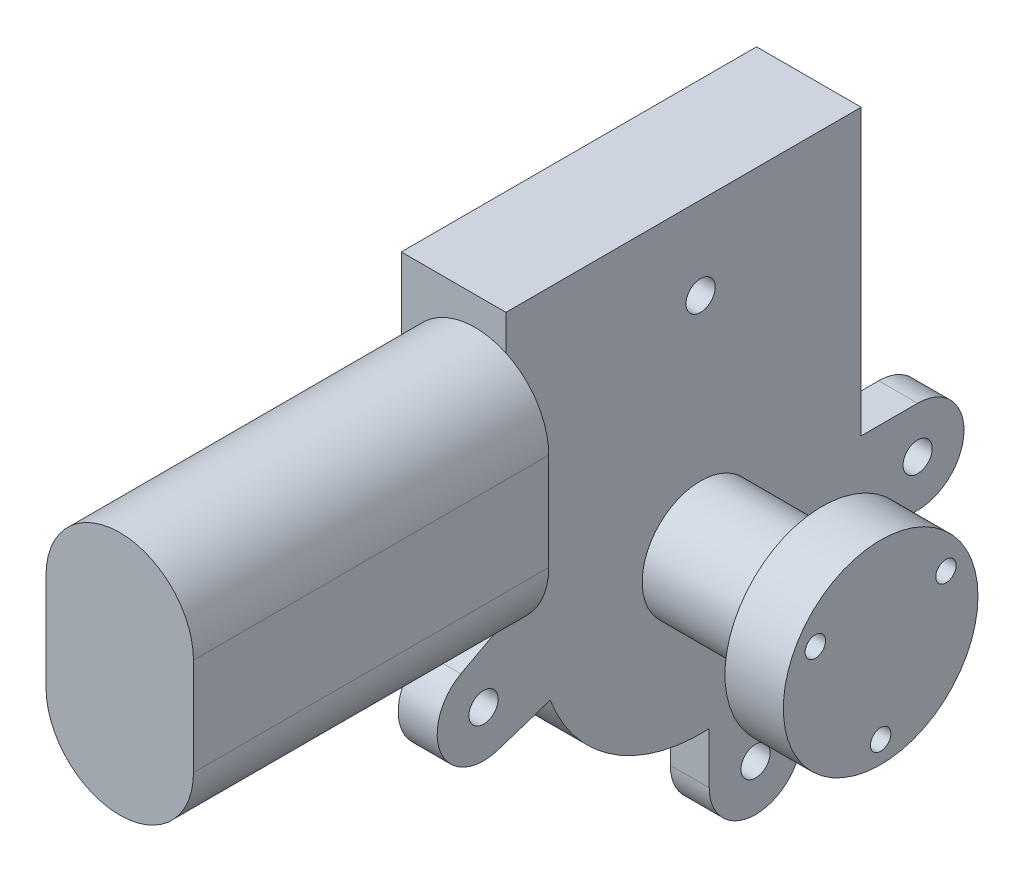
ISO-10303-21;
HEADER;
FILE_DESCRIPTION(('STEP AP214'),'2;1');
FILE_NAME('part.step','',(''),(''),'','','');
FILE_SCHEMA(('AUTOMOTIVE_DESIGN { 1 0 10303 214 1 1 1 1 }'));
ENDSEC;
DATA;
#1=APPLICATION_CONTEXT('core data for automotive mechanical design processes');
#2=APPLICATION_PROTOCOL_DEFINITION('international standard','automotive_design',2000,#1);
#3=PRODUCT_CONTEXT('',#1,'mechanical');
#4=PRODUCT('Part','Part','',(#3));
#5=PRODUCT_RELATED_PRODUCT_CATEGORY('part','',(#4));
#6=PRODUCT_DEFINITION_FORMATION('','',#4);
#7=PRODUCT_DEFINITION_CONTEXT('part definition',#1,'design');
#8=PRODUCT_DEFINITION('design','',#6,#7);
#9=PRODUCT_DEFINITION_SHAPE('','',#8);
#10=(LENGTH_UNIT() NAMED_UNIT(*) SI_UNIT(.MILLI.,.METRE.));
#11=(NAMED_UNIT(*) PLANE_ANGLE_UNIT() SI_UNIT($,.RADIAN.));
#12=(NAMED_UNIT(*) SI_UNIT($,.STERADIAN.) SOLID_ANGLE_UNIT());
#13=UNCERTAINTY_MEASURE_WITH_UNIT(LENGTH_MEASURE(1.E-05),#10,'distance_accuracy_value','');
#14=(GEOMETRIC_REPRESENTATION_CONTEXT(3) GLOBAL_UNCERTAINTY_ASSIGNED_CONTEXT((#13)) GLOBAL_UNIT_ASSIGNED_CONTEXT((#10,
#11,#12)) REPRESENTATION_CONTEXT('',''));
#15=CARTESIAN_POINT('',(0.,0.,0.));
#16=DIRECTION('',(0.,0.,1.));
#17=DIRECTION('',(1.,0.,0.));
#18=AXIS2_PLACEMENT_3D('',#15,#16,#17);
#19=CARTESIAN_POINT('',(0.,0.,73.));
#20=DIRECTION('',(0.,1.,0.));
#21=DIRECTION('',(0.,0.,1.));
#22=AXIS2_PLACEMENT_3D('',#19,#20,#21);
#23=PLANE('',#22);
#24=DIRECTION('',(0.,0.,-1.));
#25=VECTOR('',#24,1.);
#26=CARTESIAN_POINT('',(13.5,0.,73.));
#27=LINE('',#26,#25);
#28=CARTESIAN_POINT('',(13.5,0.,73.));
#29=VERTEX_POINT('',#28);
#30=CARTESIAN_POINT('',(13.5,0.,66.));
#31=VERTEX_POINT('',#30);
#32=EDGE_CURVE('E246',#29,#31,#27,.T.);
#33=ORIENTED_EDGE('',*,*,#32,.F.);
#34=DIRECTION('',(1.,0.,0.));
#35=VECTOR('',#34,1.);
#36=CARTESIAN_POINT('',(0.,0.,73.));
#37=LINE('',#36,#35);
#38=CARTESIAN_POINT('',(0.,0.,73.));
#39=VERTEX_POINT('',#38);
#40=EDGE_CURVE('E340',#39,#29,#37,.T.);
#41=ORIENTED_EDGE('',*,*,#40,.F.);
#42=DIRECTION('',(0.,0.,-1.));
#43=VECTOR('',#42,1.);
#44=CARTESIAN_POINT('',(0.,0.,73.));
#45=LINE('',#44,#43);
#46=CARTESIAN_POINT('',(0.,0.,66.));
#47=VERTEX_POINT('',#46);
#48=EDGE_CURVE('E364',#39,#47,#45,.T.);
#49=ORIENTED_EDGE('',*,*,#48,.T.);
#50=DIRECTION('',(-1.,0.,0.));
#51=VECTOR('',#50,1.);
#52=CARTESIAN_POINT('',(21.5,0.,66.));
#53=LINE('',#52,#51);
#54=EDGE_CURVE('E367',#47,#31,#53,.F.);
#55=ORIENTED_EDGE('',*,*,#54,.T.);
#56=EDGE_LOOP('',(#33,#41,#49,#55));
#57=FACE_BOUND('',#56,.T.);
#58=ADVANCED_FACE('F38',(#57),#23,.F.);
#59=CARTESIAN_POINT('',(0.,0.,73.));
#60=DIRECTION('',(0.,0.,-1.));
#61=DIRECTION('',(-1.,0.,0.));
#62=AXIS2_PLACEMENT_3D('',#59,#60,#61);
#63=PLANE('',#62);
#64=DIRECTION('',(0.,-1.,0.));
#65=VECTOR('',#64,1.);
#66=CARTESIAN_POINT('',(13.5,0.,73.));
#67=LINE('',#66,#65);
#68=CARTESIAN_POINT('',(13.5,5.94011952238664,73.));
#69=VERTEX_POINT('',#68);
#70=EDGE_CURVE('E240',#69,#29,#67,.T.);
#71=ORIENTED_EDGE('',*,*,#70,.F.);
#72=CARTESIAN_POINT('',(15.15,21.,73.));
#73=DIRECTION('',(0.,0.,1.));
#74=DIRECTION('',(1.,0.,0.));
#75=AXIS2_PLACEMENT_3D('',#72,#73,#74);
#76=CIRCLE('',#75,15.15);
#77=CARTESIAN_POINT('',(0.,21.,73.));
#78=VERTEX_POINT('',#77);
#79=EDGE_CURVE('E323',#78,#69,#76,.T.);
#80=ORIENTED_EDGE('',*,*,#79,.F.);
#81=DIRECTION('',(0.,-1.,0.));
#82=VECTOR('',#81,1.);
#83=CARTESIAN_POINT('',(0.,0.,73.));
#84=LINE('',#83,#82);
#85=EDGE_CURVE('E341',#78,#39,#84,.T.);
#86=ORIENTED_EDGE('',*,*,#85,.T.);
#87=ORIENTED_EDGE('',*,*,#40,.T.);
#88=EDGE_LOOP('',(#71,#80,#86,#87));
#89=FACE_BOUND('',#88,.T.);
#90=ADVANCED_FACE('F426',(#89),#63,.F.);
#91=CARTESIAN_POINT('',(15.15,41.,73.));
#92=DIRECTION('',(0.,0.,1.));
#93=DIRECTION('',(1.,0.,0.));
#94=AXIS2_PLACEMENT_3D('',#91,#92,#93);
#95=CIRCLE('',#94,15.15);
#96=CARTESIAN_POINT('',(21.5,54.7549990912395,73.));
#97=VERTEX_POINT('',#96);
#98=CARTESIAN_POINT('',(0.,41.,73.));
#99=VERTEX_POINT('',#98);
#100=EDGE_CURVE('E322',#97,#99,#95,.T.);
#101=ORIENTED_EDGE('',*,*,#100,.F.);
#102=DIRECTION('',(0.,1.,0.));
#103=VECTOR('',#102,1.);
#104=CARTESIAN_POINT('',(21.5,0.,73.));
#105=LINE('',#104,#103);
#106=CARTESIAN_POINT('',(21.5,62.,73.));
#107=VERTEX_POINT('',#106);
#108=EDGE_CURVE('E344',#97,#107,#105,.T.);
#109=ORIENTED_EDGE('',*,*,#108,.T.);
#110=DIRECTION('',(-1.,0.,0.));
#111=VECTOR('',#110,1.);
#112=CARTESIAN_POINT('',(0.,62.,73.));
#113=LINE('',#112,#111);
#114=CARTESIAN_POINT('',(0.,62.,73.));
#115=VERTEX_POINT('',#114);
#116=EDGE_CURVE('E347',#107,#115,#113,.T.);
#117=ORIENTED_EDGE('',*,*,#116,.T.);
#118=EDGE_CURVE('E338',#115,#99,#84,.T.);
#119=ORIENTED_EDGE('',*,*,#118,.T.);
#120=EDGE_LOOP('',(#101,#109,#117,#119));
#121=FACE_BOUND('',#120,.T.);
#122=ADVANCED_FACE('F448',(#121),#63,.F.);
#123=CARTESIAN_POINT('',(21.5,0.,33.));
#124=DIRECTION('',(-1.,0.,0.));
#125=DIRECTION('',(0.,0.,1.));
#126=AXIS2_PLACEMENT_3D('',#123,#124,#125);
#127=CYLINDRICAL_SURFACE('',#126,33.);
#128=CARTESIAN_POINT('',(21.5,0.,33.));
#129=DIRECTION('',(1.,0.,0.));
#130=DIRECTION('',(0.,0.,-1.));
#131=AXIS2_PLACEMENT_3D('',#128,#129,#130);
#132=CIRCLE('',#131,33.);
#133=CARTESIAN_POINT('',(21.5,-11.5557475374894,63.9105920171356));
#134=VERTEX_POINT('',#133);
#135=CARTESIAN_POINT('',(21.5,-32.9522286803184,31.225));
#136=VERTEX_POINT('',#135);
#137=EDGE_CURVE('E59',#134,#136,#132,.T.);
#138=ORIENTED_EDGE('',*,*,#137,.F.);
#139=DIRECTION('',(1.,0.,0.));
#140=VECTOR('',#139,1.);
#141=CARTESIAN_POINT('',(13.5,-11.5557475374894,63.9105920171356));
#142=LINE('',#141,#140);
#143=CARTESIAN_POINT('',(13.5,-11.5557475374894,63.9105920171356));
#144=VERTEX_POINT('',#143);
#145=EDGE_CURVE('E54',#144,#134,#142,.T.);
#146=ORIENTED_EDGE('',*,*,#145,.F.);
#147=CARTESIAN_POINT('',(13.5,0.,33.));
#148=DIRECTION('',(1.,0.,0.));
#149=DIRECTION('',(0.,0.,-1.));
#150=AXIS2_PLACEMENT_3D('',#147,#148,#149);
#151=CIRCLE('',#150,33.);
#152=EDGE_CURVE('E249',#31,#144,#151,.T.);
#153=ORIENTED_EDGE('',*,*,#152,.F.);
#154=ORIENTED_EDGE('',*,*,#54,.F.);
#155=CARTESIAN_POINT('',(0.,0.,33.));
#156=DIRECTION('',(1.,0.,0.));
#157=DIRECTION('',(0.,0.,-1.));
#158=AXIS2_PLACEMENT_3D('',#155,#156,#157);
#159=CIRCLE('',#158,33.);
#160=CARTESIAN_POINT('',(0.,0.,0.));
#161=VERTEX_POINT('',#160);
#162=EDGE_CURVE('E373',#47,#161,#159,.T.);
#163=ORIENTED_EDGE('',*,*,#162,.T.);
#164=DIRECTION('',(1.,0.,0.));
#165=VECTOR('',#164,1.);
#166=CARTESIAN_POINT('',(0.,0.,0.));
#167=LINE('',#166,#165);
#168=CARTESIAN_POINT('',(13.5,0.,0.));
#169=VERTEX_POINT('',#168);
#170=EDGE_CURVE('E352',#161,#169,#167,.T.);
#171=ORIENTED_EDGE('',*,*,#170,.T.);
#172=CARTESIAN_POINT('',(13.5,0.,33.));
#173=DIRECTION('',(-1.,0.,0.));
#174=DIRECTION('',(0.,0.,1.));
#175=AXIS2_PLACEMENT_3D('',#172,#173,#174);
#176=CIRCLE('',#175,33.);
#177=CARTESIAN_POINT('',(13.5,-15.525,3.88000042925825));
#178=VERTEX_POINT('',#177);
#179=EDGE_CURVE('E297',#169,#178,#176,.T.);
#180=ORIENTED_EDGE('',*,*,#179,.T.);
#181=DIRECTION('',(1.,0.,0.));
#182=VECTOR('',#181,1.);
#183=CARTESIAN_POINT('',(13.5,-15.525,3.88000042925825));
#184=LINE('',#183,#182);
#185=CARTESIAN_POINT('',(21.5,-15.525,3.88000042925825));
#186=VERTEX_POINT('',#185);
#187=EDGE_CURVE('E298',#178,#186,#184,.T.);
#188=ORIENTED_EDGE('',*,*,#187,.T.);
#189=CARTESIAN_POINT('',(21.5,-25.599206530672,12.175));
#190=VERTEX_POINT('',#189);
#191=EDGE_CURVE('E375',#190,#186,#132,.T.);
#192=ORIENTED_EDGE('',*,*,#191,.F.);
#193=DIRECTION('',(1.,0.,0.));
#194=VECTOR('',#193,1.);
#195=CARTESIAN_POINT('',(13.5,-25.599206530672,12.175));
#196=LINE('',#195,#194);
#197=CARTESIAN_POINT('',(13.5,-25.599206530672,12.175));
#198=VERTEX_POINT('',#197);
#199=EDGE_CURVE('E274',#198,#190,#196,.T.);
#200=ORIENTED_EDGE('',*,*,#199,.F.);
#201=CARTESIAN_POINT('',(13.5,0.,33.));
#202=DIRECTION('',(-1.,0.,0.));
#203=DIRECTION('',(0.,0.,1.));
#204=AXIS2_PLACEMENT_3D('',#201,#202,#203);
#205=CIRCLE('',#204,33.);
#206=CARTESIAN_POINT('',(13.5,-32.9522286803184,31.225));
#207=VERTEX_POINT('',#206);
#208=EDGE_CURVE('E379',#198,#207,#205,.T.);
#209=ORIENTED_EDGE('',*,*,#208,.T.);
#210=DIRECTION('',(1.,0.,0.));
#211=VECTOR('',#210,1.);
#212=CARTESIAN_POINT('',(13.5,-32.9522286803184,31.225));
#213=LINE('',#212,#211);
#214=EDGE_CURVE('E272',#207,#136,#213,.T.);
#215=ORIENTED_EDGE('',*,*,#214,.T.);
#216=EDGE_LOOP('',(#138,#146,#153,#154,#163,#171,#180,#188,#192,#200,#209,#215));
#217=FACE_BOUND('',#216,.T.);
#218=ADVANCED_FACE('F40',(#217),#127,.T.);
#219=CARTESIAN_POINT('',(21.5,0.,33.));
#220=DIRECTION('',(1.,0.,0.));
#221=DIRECTION('',(0.,0.,-1.));
#222=AXIS2_PLACEMENT_3D('',#219,#220,#221);
#223=PLANE('',#222);
#224=CARTESIAN_POINT('',(21.5,45.,33.));
#225=DIRECTION('',(1.,0.,0.));
#226=DIRECTION('',(0.,0.,-1.));
#227=AXIS2_PLACEMENT_3D('',#224,#225,#226);
#228=CIRCLE('',#227,3.);
#229=CARTESIAN_POINT('',(21.5,45.,30.));
#230=VERTEX_POINT('',#229);
#231=EDGE_CURVE('E887',#230,#230,#228,.T.);
#232=ORIENTED_EDGE('',*,*,#231,.F.);
#233=EDGE_LOOP('',(#232));
#234=FACE_BOUND('',#233,.T.);
#235=CARTESIAN_POINT('',(21.5,-6.,-11.6));
#236=DIRECTION('',(1.,0.,0.));
#237=DIRECTION('',(0.,0.,-1.));
#238=AXIS2_PLACEMENT_3D('',#235,#236,#237);
#239=CIRCLE('',#238,3.);
#240=CARTESIAN_POINT('',(21.5,-6.,-14.6));
#241=VERTEX_POINT('',#240);
#242=EDGE_CURVE('E196',#241,#241,#239,.T.);
#243=ORIENTED_EDGE('',*,*,#242,.F.);
#244=EDGE_LOOP('',(#243));
#245=FACE_BOUND('',#244,.T.);
#246=CARTESIAN_POINT('',(21.5,-43.5,21.7));
#247=DIRECTION('',(1.,0.,0.));
#248=DIRECTION('',(0.,0.,-1.));
#249=AXIS2_PLACEMENT_3D('',#246,#247,#248);
#250=CIRCLE('',#249,3.);
#251=CARTESIAN_POINT('',(21.5,-43.5,18.7));
#252=VERTEX_POINT('',#251);
#253=EDGE_CURVE('E209',#252,#252,#250,.T.);
#254=ORIENTED_EDGE('',*,*,#253,.F.);
#255=EDGE_LOOP('',(#254));
#256=FACE_BOUND('',#255,.T.);
#257=CARTESIAN_POINT('',(21.5,-6.,77.6));
#258=DIRECTION('',(1.,0.,0.));
#259=DIRECTION('',(0.,0.,-1.));
#260=AXIS2_PLACEMENT_3D('',#257,#258,#259);
#261=CIRCLE('',#260,3.);
#262=CARTESIAN_POINT('',(21.5,-6.,74.6));
#263=VERTEX_POINT('',#262);
#264=EDGE_CURVE('E215',#263,#263,#261,.T.);
#265=ORIENTED_EDGE('',*,*,#264,.F.);
#266=EDGE_LOOP('',(#265));
#267=FACE_BOUND('',#266,.T.);
#268=DIRECTION('',(0.,0.309935279373461,-0.950757657134401));
#269=VECTOR('',#268,1.);
#270=CARTESIAN_POINT('',(21.5,-15.0559666842052,74.6478664639678));
#271=LINE('',#270,#269);
#272=CARTESIAN_POINT('',(21.5,-15.0559666842052,74.6478664639678));
#273=VERTEX_POINT('',#272);
#274=EDGE_CURVE('E225',#273,#134,#271,.T.);
#275=ORIENTED_EDGE('',*,*,#274,.T.);
#276=ORIENTED_EDGE('',*,*,#137,.T.);
#277=DIRECTION('',(0.,-1.,0.));
#278=VECTOR('',#277,1.);
#279=CARTESIAN_POINT('',(21.5,-32.9522286803184,31.225));
#280=LINE('',#279,#278);
#281=CARTESIAN_POINT('',(21.5,-43.5,31.225));
#282=VERTEX_POINT('',#281);
#283=EDGE_CURVE('E256',#136,#282,#280,.T.);
#284=ORIENTED_EDGE('',*,*,#283,.T.);
#285=CARTESIAN_POINT('',(21.5,-43.5,21.7));
#286=DIRECTION('',(1.,0.,0.));
#287=DIRECTION('',(0.,0.,1.));
#288=AXIS2_PLACEMENT_3D('',#285,#286,#287);
#289=CIRCLE('',#288,9.525);
#290=CARTESIAN_POINT('',(21.5,-43.5,12.175));
#291=VERTEX_POINT('',#290);
#292=EDGE_CURVE('E251',#282,#291,#289,.T.);
#293=ORIENTED_EDGE('',*,*,#292,.T.);
#294=DIRECTION('',(0.,1.,0.));
#295=VECTOR('',#294,1.);
#296=CARTESIAN_POINT('',(21.5,-43.5,12.175));
#297=LINE('',#296,#295);
#298=EDGE_CURVE('E265',#291,#190,#297,.T.);
#299=ORIENTED_EDGE('',*,*,#298,.T.);
#300=ORIENTED_EDGE('',*,*,#191,.T.);
#301=DIRECTION('',(0.,0.,-1.));
#302=VECTOR('',#301,1.);
#303=CARTESIAN_POINT('',(21.5,-15.525,-11.6));
#304=LINE('',#303,#302);
#305=CARTESIAN_POINT('',(21.5,-15.525,-11.6));
#306=VERTEX_POINT('',#305);
#307=EDGE_CURVE('E282',#186,#306,#304,.T.);
#308=ORIENTED_EDGE('',*,*,#307,.T.);
#309=CARTESIAN_POINT('',(21.5,-6.,-11.6));
#310=DIRECTION('',(1.,0.,0.));
#311=DIRECTION('',(0.,0.,1.));
#312=AXIS2_PLACEMENT_3D('',#309,#310,#311);
#313=CIRCLE('',#312,9.525);
#314=CARTESIAN_POINT('',(21.5,3.525,-11.6));
#315=VERTEX_POINT('',#314);
#316=EDGE_CURVE('E271',#306,#315,#313,.T.);
#317=ORIENTED_EDGE('',*,*,#316,.T.);
#318=DIRECTION('',(0.,0.,1.));
#319=VECTOR('',#318,1.);
#320=CARTESIAN_POINT('',(21.5,3.525,-11.6));
#321=LINE('',#320,#319);
#322=CARTESIAN_POINT('',(21.5,3.525,0.));
#323=VERTEX_POINT('',#322);
#324=EDGE_CURVE('E291',#315,#323,#321,.T.);
#325=ORIENTED_EDGE('',*,*,#324,.T.);
#326=DIRECTION('',(0.,1.,0.));
#327=VECTOR('',#326,1.);
#328=CARTESIAN_POINT('',(21.5,0.,0.));
#329=LINE('',#328,#327);
#330=CARTESIAN_POINT('',(21.5,62.,0.));
#331=VERTEX_POINT('',#330);
#332=EDGE_CURVE('E355',#323,#331,#329,.T.);
#333=ORIENTED_EDGE('',*,*,#332,.T.);
#334=DIRECTION('',(0.,0.,-1.));
#335=VECTOR('',#334,1.);
#336=CARTESIAN_POINT('',(21.5,62.,73.));
#337=LINE('',#336,#335);
#338=EDGE_CURVE('E361',#107,#331,#337,.T.);
#339=ORIENTED_EDGE('',*,*,#338,.F.);
#340=ORIENTED_EDGE('',*,*,#108,.F.);
#341=CARTESIAN_POINT('',(21.5,7.24500090876047,73.));
#342=VERTEX_POINT('',#341);
#343=EDGE_CURVE('E346',#342,#97,#105,.T.);
#344=ORIENTED_EDGE('',*,*,#343,.F.);
#345=DIRECTION('',(0.,-0.470542180058905,0.882377502424791));
#346=VECTOR('',#345,1.);
#347=CARTESIAN_POINT('',(21.5,2.30185189333814,82.269569588418));
#348=LINE('',#347,#346);
#349=CARTESIAN_POINT('',(21.5,2.30185189333814,82.269569588418));
#350=VERTEX_POINT('',#349);
#351=EDGE_CURVE('E221',#342,#350,#348,.T.);
#352=ORIENTED_EDGE('',*,*,#351,.T.);
#353=CARTESIAN_POINT('',(21.5,-6.,77.6));
#354=DIRECTION('',(1.,0.,0.));
#355=DIRECTION('',(0.,0.,-1.));
#356=AXIS2_PLACEMENT_3D('',#353,#354,#355);
#357=CIRCLE('',#356,9.525);
#358=EDGE_CURVE('E234',#350,#273,#357,.T.);
#359=ORIENTED_EDGE('',*,*,#358,.T.);
#360=EDGE_LOOP('',(#275,#276,#284,#293,#299,#300,#308,#317,#325,#333,#339,#340,#344,#352,#359));
#361=FACE_BOUND('',#360,.T.);
#362=CARTESIAN_POINT('',(21.5,0.,33.));
#363=DIRECTION('',(1.,0.,0.));
#364=DIRECTION('',(0.,0.,-1.));
#365=AXIS2_PLACEMENT_3D('',#362,#363,#364);
#366=CIRCLE('',#365,12.);
#367=CARTESIAN_POINT('',(21.5,0.,21.));
#368=VERTEX_POINT('',#367);
#369=EDGE_CURVE('E912',#368,#368,#366,.T.);
#370=ORIENTED_EDGE('',*,*,#369,.F.);
#371=EDGE_LOOP('',(#370));
#372=FACE_BOUND('',#371,.T.);
#373=ADVANCED_FACE('F398',(#234,#245,#256,#267,#361,#372),#223,.T.);
#374=CARTESIAN_POINT('',(0.,0.,33.));
#375=DIRECTION('',(1.,0.,0.));
#376=DIRECTION('',(0.,0.,-1.));
#377=AXIS2_PLACEMENT_3D('',#374,#375,#376);
#378=PLANE('',#377);
#379=ORIENTED_EDGE('',*,*,#162,.F.);
#380=ORIENTED_EDGE('',*,*,#48,.F.);
#381=ORIENTED_EDGE('',*,*,#85,.F.);
#382=DIRECTION('',(0.,0.,-1.));
#383=VECTOR('',#382,1.);
#384=CARTESIAN_POINT('',(0.,21.,146.));
#385=LINE('',#384,#383);
#386=CARTESIAN_POINT('',(0.,21.,146.));
#387=VERTEX_POINT('',#386);
#388=EDGE_CURVE('E331',#387,#78,#385,.T.);
#389=ORIENTED_EDGE('',*,*,#388,.F.);
#390=DIRECTION('',(0.,-1.,0.));
#391=VECTOR('',#390,1.);
#392=CARTESIAN_POINT('',(0.,41.,146.));
#393=LINE('',#392,#391);
#394=CARTESIAN_POINT('',(0.,41.,146.));
#395=VERTEX_POINT('',#394);
#396=EDGE_CURVE('E311',#395,#387,#393,.T.);
#397=ORIENTED_EDGE('',*,*,#396,.F.);
#398=DIRECTION('',(0.,0.,-1.));
#399=VECTOR('',#398,1.);
#400=CARTESIAN_POINT('',(0.,41.,146.));
#401=LINE('',#400,#399);
#402=EDGE_CURVE('E334',#395,#99,#401,.T.);
#403=ORIENTED_EDGE('',*,*,#402,.T.);
#404=ORIENTED_EDGE('',*,*,#118,.F.);
#405=DIRECTION('',(0.,0.,-1.));
#406=VECTOR('',#405,1.);
#407=CARTESIAN_POINT('',(0.,62.,73.));
#408=LINE('',#407,#406);
#409=CARTESIAN_POINT('',(0.,62.,0.));
#410=VERTEX_POINT('',#409);
#411=EDGE_CURVE('E349',#115,#410,#408,.T.);
#412=ORIENTED_EDGE('',*,*,#411,.T.);
#413=DIRECTION('',(0.,-1.,0.));
#414=VECTOR('',#413,1.);
#415=CARTESIAN_POINT('',(0.,0.,0.));
#416=LINE('',#415,#414);
#417=EDGE_CURVE('E337',#410,#161,#416,.T.);
#418=ORIENTED_EDGE('',*,*,#417,.T.);
#419=EDGE_LOOP('',(#379,#380,#381,#389,#397,#403,#404,#412,#418));
#420=FACE_BOUND('',#419,.T.);
#421=ADVANCED_FACE('F422',(#420),#378,.F.);
#422=CARTESIAN_POINT('',(0.,62.,73.));
#423=DIRECTION('',(0.,-1.,0.));
#424=DIRECTION('',(0.,0.,-1.));
#425=AXIS2_PLACEMENT_3D('',#422,#423,#424);
#426=PLANE('',#425);
#427=DIRECTION('',(-1.,0.,0.));
#428=VECTOR('',#427,1.);
#429=CARTESIAN_POINT('',(0.,62.,0.));
#430=LINE('',#429,#428);
#431=EDGE_CURVE('E357',#331,#410,#430,.T.);
#432=ORIENTED_EDGE('',*,*,#431,.T.);
#433=ORIENTED_EDGE('',*,*,#411,.F.);
#434=ORIENTED_EDGE('',*,*,#116,.F.);
#435=ORIENTED_EDGE('',*,*,#338,.T.);
#436=EDGE_LOOP('',(#432,#433,#434,#435));
#437=FACE_BOUND('',#436,.T.);
#438=ADVANCED_FACE('F452',(#437),#426,.F.);
#439=CARTESIAN_POINT('',(0.,0.,0.));
#440=DIRECTION('',(0.,0.,-1.));
#441=DIRECTION('',(-1.,0.,0.));
#442=AXIS2_PLACEMENT_3D('',#439,#440,#441);
#443=PLANE('',#442);
#444=DIRECTION('',(1.,0.,0.));
#445=VECTOR('',#444,1.);
#446=CARTESIAN_POINT('',(13.5,3.525,0.));
#447=LINE('',#446,#445);
#448=CARTESIAN_POINT('',(13.5,3.525,0.));
#449=VERTEX_POINT('',#448);
#450=EDGE_CURVE('E301',#449,#323,#447,.T.);
#451=ORIENTED_EDGE('',*,*,#450,.F.);
#452=DIRECTION('',(0.,1.,0.));
#453=VECTOR('',#452,1.);
#454=CARTESIAN_POINT('',(13.5,0.,0.));
#455=LINE('',#454,#453);
#456=EDGE_CURVE('E377',#169,#449,#455,.T.);
#457=ORIENTED_EDGE('',*,*,#456,.F.);
#458=ORIENTED_EDGE('',*,*,#170,.F.);
#459=ORIENTED_EDGE('',*,*,#417,.F.);
#460=ORIENTED_EDGE('',*,*,#431,.F.);
#461=ORIENTED_EDGE('',*,*,#332,.F.);
#462=EDGE_LOOP('',(#451,#457,#458,#459,#460,#461));
#463=FACE_BOUND('',#462,.T.);
#464=ADVANCED_FACE('F472',(#463),#443,.T.);
#465=CARTESIAN_POINT('',(15.15,41.,73.));
#466=DIRECTION('',(0.,0.,1.));
#467=DIRECTION('',(1.,0.,0.));
#468=AXIS2_PLACEMENT_3D('',#465,#466,#467);
#469=PLANE('',#468);
#470=CARTESIAN_POINT('',(30.3,21.,73.));
#471=VERTEX_POINT('',#470);
#472=EDGE_CURVE('E321',#342,#471,#76,.T.);
#473=ORIENTED_EDGE('',*,*,#472,.F.);
#474=ORIENTED_EDGE('',*,*,#343,.T.);
#475=CARTESIAN_POINT('',(30.3,41.,73.));
#476=VERTEX_POINT('',#475);
#477=EDGE_CURVE('E307',#476,#97,#95,.T.);
#478=ORIENTED_EDGE('',*,*,#477,.F.);
#479=DIRECTION('',(0.,1.,0.));
#480=VECTOR('',#479,1.);
#481=CARTESIAN_POINT('',(30.3,41.,73.));
#482=LINE('',#481,#480);
#483=EDGE_CURVE('E312',#471,#476,#482,.T.);
#484=ORIENTED_EDGE('',*,*,#483,.F.);
#485=EDGE_LOOP('',(#473,#474,#478,#484));
#486=FACE_BOUND('',#485,.T.);
#487=ADVANCED_FACE('F407',(#486),#469,.F.);
#488=CARTESIAN_POINT('',(15.15,41.,146.));
#489=DIRECTION('',(0.,0.,-1.));
#490=DIRECTION('',(-1.,0.,0.));
#491=AXIS2_PLACEMENT_3D('',#488,#489,#490);
#492=CYLINDRICAL_SURFACE('',#491,15.15);
#493=ORIENTED_EDGE('',*,*,#477,.T.);
#494=ORIENTED_EDGE('',*,*,#100,.T.);
#495=ORIENTED_EDGE('',*,*,#402,.F.);
#496=CARTESIAN_POINT('',(15.15,41.,146.));
#497=DIRECTION('',(0.,0.,1.));
#498=DIRECTION('',(1.,0.,0.));
#499=AXIS2_PLACEMENT_3D('',#496,#497,#498);
#500=CIRCLE('',#499,15.15);
#501=CARTESIAN_POINT('',(30.3,41.,146.));
#502=VERTEX_POINT('',#501);
#503=EDGE_CURVE('E308',#502,#395,#500,.T.);
#504=ORIENTED_EDGE('',*,*,#503,.F.);
#505=DIRECTION('',(0.,0.,-1.));
#506=VECTOR('',#505,1.);
#507=CARTESIAN_POINT('',(30.3,41.,146.));
#508=LINE('',#507,#506);
#509=EDGE_CURVE('E318',#502,#476,#508,.T.);
#510=ORIENTED_EDGE('',*,*,#509,.T.);
#511=EDGE_LOOP('',(#493,#494,#495,#504,#510));
#512=FACE_BOUND('',#511,.T.);
#513=ADVANCED_FACE('F539',(#512),#492,.T.);
#514=CARTESIAN_POINT('',(15.15,21.,146.));
#515=DIRECTION('',(0.,0.,-1.));
#516=DIRECTION('',(-1.,0.,0.));
#517=AXIS2_PLACEMENT_3D('',#514,#515,#516);
#518=CYLINDRICAL_SURFACE('',#517,15.15);
#519=DIRECTION('',(0.,0.,-1.));
#520=VECTOR('',#519,1.);
#521=CARTESIAN_POINT('',(13.5,5.94011952238664,146.));
#522=LINE('',#521,#520);
#523=CARTESIAN_POINT('',(13.5,5.94011952238664,75.4469601822413));
#524=VERTEX_POINT('',#523);
#525=EDGE_CURVE('E47',#524,#69,#522,.T.);
#526=ORIENTED_EDGE('',*,*,#525,.F.);
#527=CARTESIAN_POINT('',(15.15,21.,47.2061344161244));
#528=DIRECTION('',(0.,0.882377502424791,0.470542180058905));
#529=DIRECTION('',(0.,0.470542180058905,-0.882377502424791));
#530=AXIS2_PLACEMENT_3D('',#527,#528,#529);
#531=ELLIPSE('',#530,32.196901026181,15.15);
#532=EDGE_CURVE('E11',#524,#342,#531,.T.);
#533=ORIENTED_EDGE('',*,*,#532,.T.);
#534=ORIENTED_EDGE('',*,*,#472,.T.);
#535=DIRECTION('',(0.,0.,-1.));
#536=VECTOR('',#535,1.);
#537=CARTESIAN_POINT('',(30.3,21.,146.));
#538=LINE('',#537,#536);
#539=CARTESIAN_POINT('',(30.3,21.,146.));
#540=VERTEX_POINT('',#539);
#541=EDGE_CURVE('E328',#540,#471,#538,.T.);
#542=ORIENTED_EDGE('',*,*,#541,.F.);
#543=CARTESIAN_POINT('',(15.15,21.,146.));
#544=DIRECTION('',(0.,0.,1.));
#545=DIRECTION('',(1.,0.,0.));
#546=AXIS2_PLACEMENT_3D('',#543,#544,#545);
#547=CIRCLE('',#546,15.15);
#548=EDGE_CURVE('E314',#387,#540,#547,.T.);
#549=ORIENTED_EDGE('',*,*,#548,.F.);
#550=ORIENTED_EDGE('',*,*,#388,.T.);
#551=ORIENTED_EDGE('',*,*,#79,.T.);
#552=EDGE_LOOP('',(#526,#533,#534,#542,#549,#550,#551));
#553=FACE_BOUND('',#552,.T.);
#554=ADVANCED_FACE('F390',(#553),#518,.T.);
#555=CARTESIAN_POINT('',(30.3,41.,146.));
#556=DIRECTION('',(-1.,0.,0.));
#557=DIRECTION('',(0.,0.,1.));
#558=AXIS2_PLACEMENT_3D('',#555,#556,#557);
#559=PLANE('',#558);
#560=ORIENTED_EDGE('',*,*,#483,.T.);
#561=ORIENTED_EDGE('',*,*,#509,.F.);
#562=DIRECTION('',(0.,1.,0.));
#563=VECTOR('',#562,1.);
#564=CARTESIAN_POINT('',(30.3,41.,146.));
#565=LINE('',#564,#563);
#566=EDGE_CURVE('E316',#540,#502,#565,.T.);
#567=ORIENTED_EDGE('',*,*,#566,.F.);
#568=ORIENTED_EDGE('',*,*,#541,.T.);
#569=EDGE_LOOP('',(#560,#561,#567,#568));
#570=FACE_BOUND('',#569,.T.);
#571=ADVANCED_FACE('F412',(#570),#559,.F.);
#572=CARTESIAN_POINT('',(15.15,41.,146.));
#573=DIRECTION('',(0.,0.,1.));
#574=DIRECTION('',(1.,0.,0.));
#575=AXIS2_PLACEMENT_3D('',#572,#573,#574);
#576=PLANE('',#575);
#577=ORIENTED_EDGE('',*,*,#503,.T.);
#578=ORIENTED_EDGE('',*,*,#396,.T.);
#579=ORIENTED_EDGE('',*,*,#548,.T.);
#580=ORIENTED_EDGE('',*,*,#566,.T.);
#581=EDGE_LOOP('',(#577,#578,#579,#580));
#582=FACE_BOUND('',#581,.T.);
#583=ADVANCED_FACE('F416',(#582),#576,.T.);
#584=CARTESIAN_POINT('',(13.5,-6.,-11.6));
#585=DIRECTION('',(-1.,0.,0.));
#586=DIRECTION('',(0.,0.,1.));
#587=AXIS2_PLACEMENT_3D('',#584,#585,#586);
#588=PLANE('',#587);
#589=CARTESIAN_POINT('',(13.5,-6.,-11.6));
#590=DIRECTION('',(-1.,0.,0.));
#591=DIRECTION('',(0.,0.,1.));
#592=AXIS2_PLACEMENT_3D('',#589,#590,#591);
#593=CIRCLE('',#592,3.);
#594=CARTESIAN_POINT('',(13.5,-6.,-8.6));
#595=VERTEX_POINT('',#594);
#596=EDGE_CURVE('E200',#595,#595,#593,.T.);
#597=ORIENTED_EDGE('',*,*,#596,.F.);
#598=EDGE_LOOP('',(#597));
#599=FACE_BOUND('',#598,.T.);
#600=ORIENTED_EDGE('',*,*,#179,.F.);
#601=ORIENTED_EDGE('',*,*,#456,.T.);
#602=DIRECTION('',(0.,0.,1.));
#603=VECTOR('',#602,1.);
#604=CARTESIAN_POINT('',(13.5,3.525,-11.6));
#605=LINE('',#604,#603);
#606=CARTESIAN_POINT('',(13.5,3.525,-11.6));
#607=VERTEX_POINT('',#606);
#608=EDGE_CURVE('E281',#607,#449,#605,.T.);
#609=ORIENTED_EDGE('',*,*,#608,.F.);
#610=CARTESIAN_POINT('',(13.5,-6.,-11.6));
#611=DIRECTION('',(1.,0.,0.));
#612=DIRECTION('',(0.,0.,1.));
#613=AXIS2_PLACEMENT_3D('',#610,#611,#612);
#614=CIRCLE('',#613,9.525);
#615=CARTESIAN_POINT('',(13.5,-15.525,-11.6));
#616=VERTEX_POINT('',#615);
#617=EDGE_CURVE('E278',#616,#607,#614,.T.);
#618=ORIENTED_EDGE('',*,*,#617,.F.);
#619=DIRECTION('',(0.,0.,-1.));
#620=VECTOR('',#619,1.);
#621=CARTESIAN_POINT('',(13.5,-15.525,-11.6));
#622=LINE('',#621,#620);
#623=EDGE_CURVE('E285',#178,#616,#622,.T.);
#624=ORIENTED_EDGE('',*,*,#623,.F.);
#625=EDGE_LOOP('',(#600,#601,#609,#618,#624));
#626=FACE_BOUND('',#625,.T.);
#627=ADVANCED_FACE('F490',(#599,#626),#588,.T.);
#628=CARTESIAN_POINT('',(13.5,-6.,-11.6));
#629=DIRECTION('',(1.,0.,0.));
#630=DIRECTION('',(0.,0.,-1.));
#631=AXIS2_PLACEMENT_3D('',#628,#629,#630);
#632=CYLINDRICAL_SURFACE('',#631,9.525);
#633=ORIENTED_EDGE('',*,*,#316,.F.);
#634=DIRECTION('',(1.,0.,0.));
#635=VECTOR('',#634,1.);
#636=CARTESIAN_POINT('',(13.5,-15.525,-11.6));
#637=LINE('',#636,#635);
#638=EDGE_CURVE('E295',#616,#306,#637,.T.);
#639=ORIENTED_EDGE('',*,*,#638,.F.);
#640=ORIENTED_EDGE('',*,*,#617,.T.);
#641=DIRECTION('',(1.,0.,0.));
#642=VECTOR('',#641,1.);
#643=CARTESIAN_POINT('',(13.5,3.525,-11.6));
#644=LINE('',#643,#642);
#645=EDGE_CURVE('E288',#607,#315,#644,.T.);
#646=ORIENTED_EDGE('',*,*,#645,.T.);
#647=EDGE_LOOP('',(#633,#639,#640,#646));
#648=FACE_BOUND('',#647,.T.);
#649=ADVANCED_FACE('F525',(#648),#632,.T.);
#650=CARTESIAN_POINT('',(13.5,-15.525,-11.6));
#651=DIRECTION('',(0.,-1.,0.));
#652=DIRECTION('',(0.,0.,-1.));
#653=AXIS2_PLACEMENT_3D('',#650,#651,#652);
#654=PLANE('',#653);
#655=ORIENTED_EDGE('',*,*,#307,.F.);
#656=ORIENTED_EDGE('',*,*,#187,.F.);
#657=ORIENTED_EDGE('',*,*,#623,.T.);
#658=ORIENTED_EDGE('',*,*,#638,.T.);
#659=EDGE_LOOP('',(#655,#656,#657,#658));
#660=FACE_BOUND('',#659,.T.);
#661=ADVANCED_FACE('F495',(#660),#654,.T.);
#662=CARTESIAN_POINT('',(13.5,3.525,-11.6));
#663=DIRECTION('',(0.,1.,0.));
#664=DIRECTION('',(0.,0.,1.));
#665=AXIS2_PLACEMENT_3D('',#662,#663,#664);
#666=PLANE('',#665);
#667=ORIENTED_EDGE('',*,*,#324,.F.);
#668=ORIENTED_EDGE('',*,*,#645,.F.);
#669=ORIENTED_EDGE('',*,*,#608,.T.);
#670=ORIENTED_EDGE('',*,*,#450,.T.);
#671=EDGE_LOOP('',(#667,#668,#669,#670));
#672=FACE_BOUND('',#671,.T.);
#673=ADVANCED_FACE('F519',(#672),#666,.T.);
#674=CARTESIAN_POINT('',(13.5,-43.5,21.7));
#675=DIRECTION('',(1.,0.,0.));
#676=DIRECTION('',(0.,0.,-1.));
#677=AXIS2_PLACEMENT_3D('',#674,#675,#676);
#678=CYLINDRICAL_SURFACE('',#677,9.525);
#679=ORIENTED_EDGE('',*,*,#292,.F.);
#680=DIRECTION('',(1.,0.,0.));
#681=VECTOR('',#680,1.);
#682=CARTESIAN_POINT('',(13.5,-43.5,31.225));
#683=LINE('',#682,#681);
#684=CARTESIAN_POINT('',(13.5,-43.5,31.225));
#685=VERTEX_POINT('',#684);
#686=EDGE_CURVE('E269',#685,#282,#683,.T.);
#687=ORIENTED_EDGE('',*,*,#686,.F.);
#688=CARTESIAN_POINT('',(13.5,-43.5,21.7));
#689=DIRECTION('',(1.,0.,0.));
#690=DIRECTION('',(0.,0.,1.));
#691=AXIS2_PLACEMENT_3D('',#688,#689,#690);
#692=CIRCLE('',#691,9.525);
#693=CARTESIAN_POINT('',(13.5,-43.5,12.175));
#694=VERTEX_POINT('',#693);
#695=EDGE_CURVE('E252',#685,#694,#692,.T.);
#696=ORIENTED_EDGE('',*,*,#695,.T.);
#697=DIRECTION('',(1.,0.,0.));
#698=VECTOR('',#697,1.);
#699=CARTESIAN_POINT('',(13.5,-43.5,12.175));
#700=LINE('',#699,#698);
#701=EDGE_CURVE('E262',#694,#291,#700,.T.);
#702=ORIENTED_EDGE('',*,*,#701,.T.);
#703=EDGE_LOOP('',(#679,#687,#696,#702));
#704=FACE_BOUND('',#703,.T.);
#705=ADVANCED_FACE('F508',(#704),#678,.T.);
#706=CARTESIAN_POINT('',(13.5,-32.9522286803184,31.225));
#707=DIRECTION('',(0.,0.,1.));
#708=DIRECTION('',(0.,-1.,0.));
#709=AXIS2_PLACEMENT_3D('',#706,#707,#708);
#710=PLANE('',#709);
#711=ORIENTED_EDGE('',*,*,#283,.F.);
#712=ORIENTED_EDGE('',*,*,#214,.F.);
#713=DIRECTION('',(0.,-1.,0.));
#714=VECTOR('',#713,1.);
#715=CARTESIAN_POINT('',(13.5,-32.9522286803184,31.225));
#716=LINE('',#715,#714);
#717=EDGE_CURVE('E259',#207,#685,#716,.T.);
#718=ORIENTED_EDGE('',*,*,#717,.T.);
#719=ORIENTED_EDGE('',*,*,#686,.T.);
#720=EDGE_LOOP('',(#711,#712,#718,#719));
#721=FACE_BOUND('',#720,.T.);
#722=ADVANCED_FACE('F511',(#721),#710,.T.);
#723=CARTESIAN_POINT('',(13.5,-43.5,12.175));
#724=DIRECTION('',(0.,0.,-1.));
#725=DIRECTION('',(0.,1.,0.));
#726=AXIS2_PLACEMENT_3D('',#723,#724,#725);
#727=PLANE('',#726);
#728=ORIENTED_EDGE('',*,*,#298,.F.);
#729=ORIENTED_EDGE('',*,*,#701,.F.);
#730=DIRECTION('',(0.,1.,0.));
#731=VECTOR('',#730,1.);
#732=CARTESIAN_POINT('',(13.5,-43.5,12.175));
#733=LINE('',#732,#731);
#734=EDGE_CURVE('E255',#694,#198,#733,.T.);
#735=ORIENTED_EDGE('',*,*,#734,.T.);
#736=ORIENTED_EDGE('',*,*,#199,.T.);
#737=EDGE_LOOP('',(#728,#729,#735,#736));
#738=FACE_BOUND('',#737,.T.);
#739=ADVANCED_FACE('F500',(#738),#727,.T.);
#740=CARTESIAN_POINT('',(13.5,-43.5,21.7));
#741=DIRECTION('',(-1.,0.,0.));
#742=DIRECTION('',(0.,0.,1.));
#743=AXIS2_PLACEMENT_3D('',#740,#741,#742);
#744=PLANE('',#743);
#745=CARTESIAN_POINT('',(13.5,-43.5,21.7));
#746=DIRECTION('',(-1.,0.,0.));
#747=DIRECTION('',(0.,0.,1.));
#748=AXIS2_PLACEMENT_3D('',#745,#746,#747);
#749=CIRCLE('',#748,3.);
#750=CARTESIAN_POINT('',(13.5,-43.5,24.7));
#751=VERTEX_POINT('',#750);
#752=EDGE_CURVE('E212',#751,#751,#749,.T.);
#753=ORIENTED_EDGE('',*,*,#752,.F.);
#754=EDGE_LOOP('',(#753));
#755=FACE_BOUND('',#754,.T.);
#756=ORIENTED_EDGE('',*,*,#208,.F.);
#757=ORIENTED_EDGE('',*,*,#734,.F.);
#758=ORIENTED_EDGE('',*,*,#695,.F.);
#759=ORIENTED_EDGE('',*,*,#717,.F.);
#760=EDGE_LOOP('',(#756,#757,#758,#759));
#761=FACE_BOUND('',#760,.T.);
#762=ADVANCED_FACE('F504',(#755,#761),#744,.T.);
#763=CARTESIAN_POINT('',(13.5,-6.,77.6));
#764=DIRECTION('',(1.,0.,0.));
#765=DIRECTION('',(0.,0.,-1.));
#766=AXIS2_PLACEMENT_3D('',#763,#764,#765);
#767=PLANE('',#766);
#768=CARTESIAN_POINT('',(13.5,-6.,77.6));
#769=DIRECTION('',(1.,0.,0.));
#770=DIRECTION('',(0.,0.,-1.));
#771=AXIS2_PLACEMENT_3D('',#768,#769,#770);
#772=CIRCLE('',#771,3.);
#773=CARTESIAN_POINT('',(13.5,-6.,74.6));
#774=VERTEX_POINT('',#773);
#775=EDGE_CURVE('E218',#774,#774,#772,.T.);
#776=ORIENTED_EDGE('',*,*,#775,.T.);
#777=EDGE_LOOP('',(#776));
#778=FACE_BOUND('',#777,.T.);
#779=ORIENTED_EDGE('',*,*,#32,.T.);
#780=ORIENTED_EDGE('',*,*,#152,.T.);
#781=DIRECTION('',(0.,0.309935279373461,-0.950757657134401));
#782=VECTOR('',#781,1.);
#783=CARTESIAN_POINT('',(13.5,-15.0559666842052,74.6478664639678));
#784=LINE('',#783,#782);
#785=CARTESIAN_POINT('',(13.5,-15.0559666842052,74.6478664639678));
#786=VERTEX_POINT('',#785);
#787=EDGE_CURVE('E228',#786,#144,#784,.T.);
#788=ORIENTED_EDGE('',*,*,#787,.F.);
#789=CARTESIAN_POINT('',(13.5,-6.,77.6));
#790=DIRECTION('',(1.,0.,0.));
#791=DIRECTION('',(0.,0.,-1.));
#792=AXIS2_PLACEMENT_3D('',#789,#790,#791);
#793=CIRCLE('',#792,9.525);
#794=CARTESIAN_POINT('',(13.5,2.30185189333814,82.269569588418));
#795=VERTEX_POINT('',#794);
#796=EDGE_CURVE('E224',#795,#786,#793,.T.);
#797=ORIENTED_EDGE('',*,*,#796,.F.);
#798=DIRECTION('',(0.,-0.470542180058905,0.882377502424791));
#799=VECTOR('',#798,1.);
#800=CARTESIAN_POINT('',(13.5,2.30185189333814,82.269569588418));
#801=LINE('',#800,#799);
#802=EDGE_CURVE('E222',#524,#795,#801,.T.);
#803=ORIENTED_EDGE('',*,*,#802,.F.);
#804=ORIENTED_EDGE('',*,*,#525,.T.);
#805=ORIENTED_EDGE('',*,*,#70,.T.);
#806=EDGE_LOOP('',(#779,#780,#788,#797,#803,#804,#805));
#807=FACE_BOUND('',#806,.T.);
#808=ADVANCED_FACE('F385',(#778,#807),#767,.F.);
#809=CARTESIAN_POINT('',(13.5,-15.0559666842052,74.6478664639678));
#810=DIRECTION('',(0.,-0.950757657134401,-0.309935279373461));
#811=DIRECTION('',(0.,0.309935279373461,-0.950757657134401));
#812=AXIS2_PLACEMENT_3D('',#809,#810,#811);
#813=PLANE('',#812);
#814=ORIENTED_EDGE('',*,*,#274,.F.);
#815=DIRECTION('',(1.,0.,0.));
#816=VECTOR('',#815,1.);
#817=CARTESIAN_POINT('',(13.5,-15.0559666842052,74.6478664639678));
#818=LINE('',#817,#816);
#819=EDGE_CURVE('E241',#786,#273,#818,.T.);
#820=ORIENTED_EDGE('',*,*,#819,.F.);
#821=ORIENTED_EDGE('',*,*,#787,.T.);
#822=ORIENTED_EDGE('',*,*,#145,.T.);
#823=EDGE_LOOP('',(#814,#820,#821,#822));
#824=FACE_BOUND('',#823,.T.);
#825=ADVANCED_FACE('F431',(#824),#813,.T.);
#826=CARTESIAN_POINT('',(13.5,-6.,77.6));
#827=DIRECTION('',(1.,0.,0.));
#828=DIRECTION('',(0.,0.,-1.));
#829=AXIS2_PLACEMENT_3D('',#826,#827,#828);
#830=CYLINDRICAL_SURFACE('',#829,9.525);
#831=ORIENTED_EDGE('',*,*,#358,.F.);
#832=DIRECTION('',(1.,0.,0.));
#833=VECTOR('',#832,1.);
#834=CARTESIAN_POINT('',(13.5,2.30185189333814,82.269569588418));
#835=LINE('',#834,#833);
#836=EDGE_CURVE('E231',#795,#350,#835,.T.);
#837=ORIENTED_EDGE('',*,*,#836,.F.);
#838=ORIENTED_EDGE('',*,*,#796,.T.);
#839=ORIENTED_EDGE('',*,*,#819,.T.);
#840=EDGE_LOOP('',(#831,#837,#838,#839));
#841=FACE_BOUND('',#840,.T.);
#842=ADVANCED_FACE('F433',(#841),#830,.T.);
#843=CARTESIAN_POINT('',(13.5,2.30185189333814,82.269569588418));
#844=DIRECTION('',(0.,0.882377502424791,0.470542180058905));
#845=DIRECTION('',(0.,-0.470542180058905,0.882377502424791));
#846=AXIS2_PLACEMENT_3D('',#843,#844,#845);
#847=PLANE('',#846);
#848=ORIENTED_EDGE('',*,*,#532,.F.);
#849=ORIENTED_EDGE('',*,*,#802,.T.);
#850=ORIENTED_EDGE('',*,*,#836,.T.);
#851=ORIENTED_EDGE('',*,*,#351,.F.);
#852=EDGE_LOOP('',(#848,#849,#850,#851));
#853=FACE_BOUND('',#852,.T.);
#854=ADVANCED_FACE('F394',(#853),#847,.T.);
#855=CARTESIAN_POINT('',(21.5,-6.,77.6));
#856=DIRECTION('',(1.,0.,0.));
#857=DIRECTION('',(0.,0.,-1.));
#858=AXIS2_PLACEMENT_3D('',#855,#856,#857);
#859=CYLINDRICAL_SURFACE('',#858,3.);
#860=ORIENTED_EDGE('',*,*,#264,.T.);
#861=EDGE_LOOP('',(#860));
#862=FACE_BOUND('',#861,.T.);
#863=ORIENTED_EDGE('',*,*,#775,.F.);
#864=EDGE_LOOP('',(#863));
#865=FACE_BOUND('',#864,.T.);
#866=ADVANCED_FACE('F440',(#862,#865),#859,.F.);
#867=CARTESIAN_POINT('',(21.5,-43.5,21.7));
#868=DIRECTION('',(1.,0.,0.));
#869=DIRECTION('',(0.,0.,-1.));
#870=AXIS2_PLACEMENT_3D('',#867,#868,#869);
#871=CYLINDRICAL_SURFACE('',#870,3.);
#872=ORIENTED_EDGE('',*,*,#752,.T.);
#873=EDGE_LOOP('',(#872));
#874=FACE_BOUND('',#873,.T.);
#875=ORIENTED_EDGE('',*,*,#253,.T.);
#876=EDGE_LOOP('',(#875));
#877=FACE_BOUND('',#876,.T.);
#878=ADVANCED_FACE('F674',(#874,#877),#871,.F.);
#879=CARTESIAN_POINT('',(21.5,-6.,-11.6));
#880=DIRECTION('',(1.,0.,0.));
#881=DIRECTION('',(0.,0.,-1.));
#882=AXIS2_PLACEMENT_3D('',#879,#880,#881);
#883=CYLINDRICAL_SURFACE('',#882,3.);
#884=ORIENTED_EDGE('',*,*,#596,.T.);
#885=EDGE_LOOP('',(#884));
#886=FACE_BOUND('',#885,.T.);
#887=ORIENTED_EDGE('',*,*,#242,.T.);
#888=EDGE_LOOP('',(#887));
#889=FACE_BOUND('',#888,.T.);
#890=ADVANCED_FACE('F190',(#886,#889),#883,.F.);
#891=CARTESIAN_POINT('',(6.51,45.,33.));
#892=DIRECTION('',(1.,0.,0.));
#893=DIRECTION('',(0.,0.,-1.));
#894=AXIS2_PLACEMENT_3D('',#891,#892,#893);
#895=CONICAL_SURFACE('',#894,2.5,1.02974425867665);
#896=CARTESIAN_POINT('',(5.00784845243109,45.,33.));
#897=VERTEX_POINT('',#896);
#898=VERTEX_LOOP('',#897);
#899=FACE_BOUND('',#898,.T.);
#900=CARTESIAN_POINT('',(6.51,45.,33.));
#901=DIRECTION('',(1.,0.,0.));
#902=DIRECTION('',(0.,0.,-1.));
#903=AXIS2_PLACEMENT_3D('',#900,#901,#902);
#904=CIRCLE('',#903,2.5);
#905=CARTESIAN_POINT('',(6.51,45.,30.5));
#906=VERTEX_POINT('',#905);
#907=EDGE_CURVE('E194',#906,#906,#904,.T.);
#908=ORIENTED_EDGE('',*,*,#907,.T.);
#909=EDGE_LOOP('',(#908));
#910=FACE_BOUND('',#909,.T.);
#911=ADVANCED_FACE('F186',(#899,#910),#895,.F.);
#912=CARTESIAN_POINT('',(21.5,45.,33.));
#913=DIRECTION('',(1.,0.,0.));
#914=DIRECTION('',(0.,0.,-1.));
#915=AXIS2_PLACEMENT_3D('',#912,#913,#914);
#916=CYLINDRICAL_SURFACE('',#915,2.5);
#917=ORIENTED_EDGE('',*,*,#907,.F.);
#918=EDGE_LOOP('',(#917));
#919=FACE_BOUND('',#918,.T.);
#920=CARTESIAN_POINT('',(9.56,45.,33.));
#921=DIRECTION('',(1.,0.,0.));
#922=DIRECTION('',(0.,0.,-1.));
#923=AXIS2_PLACEMENT_3D('',#920,#921,#922);
#924=CIRCLE('',#923,2.5);
#925=CARTESIAN_POINT('',(9.56,45.,30.5));
#926=VERTEX_POINT('',#925);
#927=EDGE_CURVE('E197',#926,#926,#924,.T.);
#928=ORIENTED_EDGE('',*,*,#927,.T.);
#929=EDGE_LOOP('',(#928));
#930=FACE_BOUND('',#929,.T.);
#931=ADVANCED_FACE('F189',(#919,#930),#916,.F.);
#932=CARTESIAN_POINT('',(9.56,47.5,33.));
#933=DIRECTION('',(-1.,0.,0.));
#934=DIRECTION('',(0.,0.,1.));
#935=AXIS2_PLACEMENT_3D('',#932,#933,#934);
#936=PLANE('',#935);
#937=ORIENTED_EDGE('',*,*,#927,.F.);
#938=EDGE_LOOP('',(#937));
#939=FACE_BOUND('',#938,.T.);
#940=CARTESIAN_POINT('',(9.56,45.,33.));
#941=DIRECTION('',(1.,0.,0.));
#942=DIRECTION('',(0.,0.,-1.));
#943=AXIS2_PLACEMENT_3D('',#940,#941,#942);
#944=CIRCLE('',#943,3.);
#945=CARTESIAN_POINT('',(9.56,45.,30.));
#946=VERTEX_POINT('',#945);
#947=EDGE_CURVE('E203',#946,#946,#944,.T.);
#948=ORIENTED_EDGE('',*,*,#947,.T.);
#949=EDGE_LOOP('',(#948));
#950=FACE_BOUND('',#949,.T.);
#951=ADVANCED_FACE('F644',(#939,#950),#936,.F.);
#952=CARTESIAN_POINT('',(21.5,45.,33.));
#953=DIRECTION('',(1.,0.,0.));
#954=DIRECTION('',(0.,0.,-1.));
#955=AXIS2_PLACEMENT_3D('',#952,#953,#954);
#956=CYLINDRICAL_SURFACE('',#955,3.);
#957=ORIENTED_EDGE('',*,*,#947,.F.);
#958=EDGE_LOOP('',(#957));
#959=FACE_BOUND('',#958,.T.);
#960=ORIENTED_EDGE('',*,*,#231,.T.);
#961=EDGE_LOOP('',(#960));
#962=FACE_BOUND('',#961,.T.);
#963=ADVANCED_FACE('F579',(#959,#962),#956,.F.);
#964=CARTESIAN_POINT('',(46.5,0.,53.));
#965=DIRECTION('',(-1.,0.,0.));
#966=DIRECTION('',(0.,0.,1.));
#967=AXIS2_PLACEMENT_3D('',#964,#965,#966);
#968=PLANE('',#967);
#969=CARTESIAN_POINT('',(46.5,0.,33.));
#970=DIRECTION('',(1.,0.,0.));
#971=DIRECTION('',(0.,0.,-1.));
#972=AXIS2_PLACEMENT_3D('',#969,#970,#971);
#973=CIRCLE('',#972,12.);
#974=CARTESIAN_POINT('',(46.5,0.,21.));
#975=VERTEX_POINT('',#974);
#976=EDGE_CURVE('E909',#975,#975,#973,.T.);
#977=ORIENTED_EDGE('',*,*,#976,.T.);
#978=EDGE_LOOP('',(#977));
#979=FACE_BOUND('',#978,.T.);
#980=CARTESIAN_POINT('',(46.5,0.,33.));
#981=DIRECTION('',(1.,0.,0.));
#982=DIRECTION('',(0.,0.,-1.));
#983=AXIS2_PLACEMENT_3D('',#980,#981,#982);
#984=CIRCLE('',#983,20.);
#985=CARTESIAN_POINT('',(46.5,0.,13.));
#986=VERTEX_POINT('',#985);
#987=EDGE_CURVE('E906',#986,#986,#984,.T.);
#988=ORIENTED_EDGE('',*,*,#987,.F.);
#989=EDGE_LOOP('',(#988));
#990=FACE_BOUND('',#989,.T.);
#991=CARTESIAN_POINT('',(46.5,-15.5,33.));
#992=DIRECTION('',(-1.,0.,0.));
#993=DIRECTION('',(0.,0.,1.));
#994=AXIS2_PLACEMENT_3D('',#991,#992,#993);
#995=CIRCLE('',#994,2.1);
#996=CARTESIAN_POINT('',(46.5,-15.5,35.1));
#997=VERTEX_POINT('',#996);
#998=EDGE_CURVE('E42',#997,#997,#995,.F.);
#999=ORIENTED_EDGE('',*,*,#998,.T.);
#1000=EDGE_LOOP('',(#999));
#1001=FACE_BOUND('',#1000,.T.);
#1002=CARTESIAN_POINT('',(46.5,7.74999999999997,46.4233937586588));
#1003=DIRECTION('',(-1.,0.,0.));
#1004=DIRECTION('',(0.,0.,1.));
#1005=AXIS2_PLACEMENT_3D('',#1002,#1003,#1004);
#1006=CIRCLE('',#1005,2.1);
#1007=CARTESIAN_POINT('',(46.5,7.74999999999997,48.5233937586588));
#1008=VERTEX_POINT('',#1007);
#1009=EDGE_CURVE('E903',#1008,#1008,#1006,.F.);
#1010=ORIENTED_EDGE('',*,*,#1009,.T.);
#1011=EDGE_LOOP('',(#1010));
#1012=FACE_BOUND('',#1011,.T.);
#1013=CARTESIAN_POINT('',(46.5,7.74999999999997,19.5766062413412));
#1014=DIRECTION('',(-1.,0.,0.));
#1015=DIRECTION('',(0.,0.,1.));
#1016=AXIS2_PLACEMENT_3D('',#1013,#1014,#1015);
#1017=CIRCLE('',#1016,2.1);
#1018=CARTESIAN_POINT('',(46.5,7.74999999999997,21.6766062413412));
#1019=VERTEX_POINT('',#1018);
#1020=EDGE_CURVE('E900',#1019,#1019,#1017,.F.);
#1021=ORIENTED_EDGE('',*,*,#1020,.T.);
#1022=EDGE_LOOP('',(#1021));
#1023=FACE_BOUND('',#1022,.T.);
#1024=ADVANCED_FACE('F575',(#979,#990,#1001,#1012,#1023),#968,.T.);
#1025=CARTESIAN_POINT('',(58.5,0.,33.));
#1026=DIRECTION('',(1.,0.,0.));
#1027=DIRECTION('',(0.,0.,-1.));
#1028=AXIS2_PLACEMENT_3D('',#1025,#1026,#1027);
#1029=CYLINDRICAL_SURFACE('',#1028,12.);
#1030=ORIENTED_EDGE('',*,*,#369,.T.);
#1031=EDGE_LOOP('',(#1030));
#1032=FACE_BOUND('',#1031,.T.);
#1033=ORIENTED_EDGE('',*,*,#976,.F.);
#1034=EDGE_LOOP('',(#1033));
#1035=FACE_BOUND('',#1034,.T.);
#1036=ADVANCED_FACE('F464',(#1032,#1035),#1029,.T.);
#1037=CARTESIAN_POINT('',(58.5,0.,33.));
#1038=DIRECTION('',(-1.,0.,0.));
#1039=DIRECTION('',(0.,0.,1.));
#1040=AXIS2_PLACEMENT_3D('',#1037,#1038,#1039);
#1041=CYLINDRICAL_SURFACE('',#1040,20.);
#1042=CARTESIAN_POINT('',(58.5,0.,33.));
#1043=DIRECTION('',(1.,0.,0.));
#1044=DIRECTION('',(0.,0.,-1.));
#1045=AXIS2_PLACEMENT_3D('',#1042,#1043,#1044);
#1046=CIRCLE('',#1045,20.);
#1047=CARTESIAN_POINT('',(58.5,0.,13.));
#1048=VERTEX_POINT('',#1047);
#1049=EDGE_CURVE('E370',#1048,#1048,#1046,.T.);
#1050=ORIENTED_EDGE('',*,*,#1049,.F.);
#1051=EDGE_LOOP('',(#1050));
#1052=FACE_BOUND('',#1051,.T.);
#1053=ORIENTED_EDGE('',*,*,#987,.T.);
#1054=EDGE_LOOP('',(#1053));
#1055=FACE_BOUND('',#1054,.T.);
#1056=ADVANCED_FACE('F460',(#1052,#1055),#1041,.T.);
#1057=CARTESIAN_POINT('',(58.5,7.74999999999997,19.5766062413412));
#1058=DIRECTION('',(1.,0.,0.));
#1059=DIRECTION('',(0.,0.,-1.));
#1060=AXIS2_PLACEMENT_3D('',#1057,#1058,#1059);
#1061=CYLINDRICAL_SURFACE('',#1060,2.1);
#1062=CARTESIAN_POINT('',(58.5,7.74999999999997,19.5766062413412));
#1063=DIRECTION('',(1.,0.,0.));
#1064=DIRECTION('',(0.,0.,-1.));
#1065=AXIS2_PLACEMENT_3D('',#1062,#1063,#1064);
#1066=CIRCLE('',#1065,2.1);
#1067=CARTESIAN_POINT('',(58.5,7.74999999999997,17.4766062413412));
#1068=VERTEX_POINT('',#1067);
#1069=EDGE_CURVE('E889',#1068,#1068,#1066,.T.);
#1070=ORIENTED_EDGE('',*,*,#1069,.T.);
#1071=EDGE_LOOP('',(#1070));
#1072=FACE_BOUND('',#1071,.T.);
#1073=ORIENTED_EDGE('',*,*,#1020,.F.);
#1074=EDGE_LOOP('',(#1073));
#1075=FACE_BOUND('',#1074,.T.);
#1076=ADVANCED_FACE('F463',(#1072,#1075),#1061,.F.);
#1077=CARTESIAN_POINT('',(58.5,7.74999999999997,46.4233937586588));
#1078=DIRECTION('',(1.,0.,0.));
#1079=DIRECTION('',(0.,0.,-1.));
#1080=AXIS2_PLACEMENT_3D('',#1077,#1078,#1079);
#1081=CYLINDRICAL_SURFACE('',#1080,2.1);
#1082=CARTESIAN_POINT('',(58.5,7.74999999999997,46.4233937586588));
#1083=DIRECTION('',(1.,0.,0.));
#1084=DIRECTION('',(0.,0.,-1.));
#1085=AXIS2_PLACEMENT_3D('',#1082,#1083,#1084);
#1086=CIRCLE('',#1085,2.1);
#1087=CARTESIAN_POINT('',(58.5,7.74999999999997,44.3233937586588));
#1088=VERTEX_POINT('',#1087);
#1089=EDGE_CURVE('E894',#1088,#1088,#1086,.T.);
#1090=ORIENTED_EDGE('',*,*,#1089,.T.);
#1091=EDGE_LOOP('',(#1090));
#1092=FACE_BOUND('',#1091,.T.);
#1093=ORIENTED_EDGE('',*,*,#1009,.F.);
#1094=EDGE_LOOP('',(#1093));
#1095=FACE_BOUND('',#1094,.T.);
#1096=ADVANCED_FACE('F458',(#1092,#1095),#1081,.F.);
#1097=CARTESIAN_POINT('',(58.5,0.,33.));
#1098=DIRECTION('',(1.,0.,0.));
#1099=DIRECTION('',(0.,0.,-1.));
#1100=AXIS2_PLACEMENT_3D('',#1097,#1098,#1099);
#1101=PLANE('',#1100);
#1102=CARTESIAN_POINT('',(58.5,-15.5,33.));
#1103=DIRECTION('',(1.,0.,0.));
#1104=DIRECTION('',(0.,0.,-1.));
#1105=AXIS2_PLACEMENT_3D('',#1102,#1103,#1104);
#1106=CIRCLE('',#1105,2.1);
#1107=CARTESIAN_POINT('',(58.5,-15.5,30.9));
#1108=VERTEX_POINT('',#1107);
#1109=EDGE_CURVE('E897',#1108,#1108,#1106,.T.);
#1110=ORIENTED_EDGE('',*,*,#1109,.F.);
#1111=EDGE_LOOP('',(#1110));
#1112=FACE_BOUND('',#1111,.T.);
#1113=ORIENTED_EDGE('',*,*,#1089,.F.);
#1114=EDGE_LOOP('',(#1113));
#1115=FACE_BOUND('',#1114,.T.);
#1116=ORIENTED_EDGE('',*,*,#1069,.F.);
#1117=EDGE_LOOP('',(#1116));
#1118=FACE_BOUND('',#1117,.T.);
#1119=ORIENTED_EDGE('',*,*,#1049,.T.);
#1120=EDGE_LOOP('',(#1119));
#1121=FACE_BOUND('',#1120,.T.);
#1122=ADVANCED_FACE('F454',(#1112,#1115,#1118,#1121),#1101,.T.);
#1123=CARTESIAN_POINT('',(58.5,-15.5,33.));
#1124=DIRECTION('',(1.,0.,0.));
#1125=DIRECTION('',(0.,0.,-1.));
#1126=AXIS2_PLACEMENT_3D('',#1123,#1124,#1125);
#1127=CYLINDRICAL_SURFACE('',#1126,2.1);
#1128=ORIENTED_EDGE('',*,*,#1109,.T.);
#1129=EDGE_LOOP('',(#1128));
#1130=FACE_BOUND('',#1129,.T.);
#1131=ORIENTED_EDGE('',*,*,#998,.F.);
#1132=EDGE_LOOP('',(#1131));
#1133=FACE_BOUND('',#1132,.T.);
#1134=ADVANCED_FACE('F457',(#1130,#1133),#1127,.F.);
#1135=CLOSED_SHELL('',(#58,#90,#122,#218,#373,#421,#438,#464,#487,#513,#554,#571,#583,#627,#649,
#661,#673,#705,#722,#739,#762,#808,#825,#842,#854,#866,#878,#890,#911,#931,#951,#963,#1024,
#1036,#1056,#1076,#1096,#1122,#1134));
#1136=MANIFOLD_SOLID_BREP('B2',#1135);
#1137=ADVANCED_BREP_SHAPE_REPRESENTATION('',(#18,#1136),#14);
#1138=SHAPE_DEFINITION_REPRESENTATION(#9,#1137);
ENDSEC;
END-ISO-10303-21;
